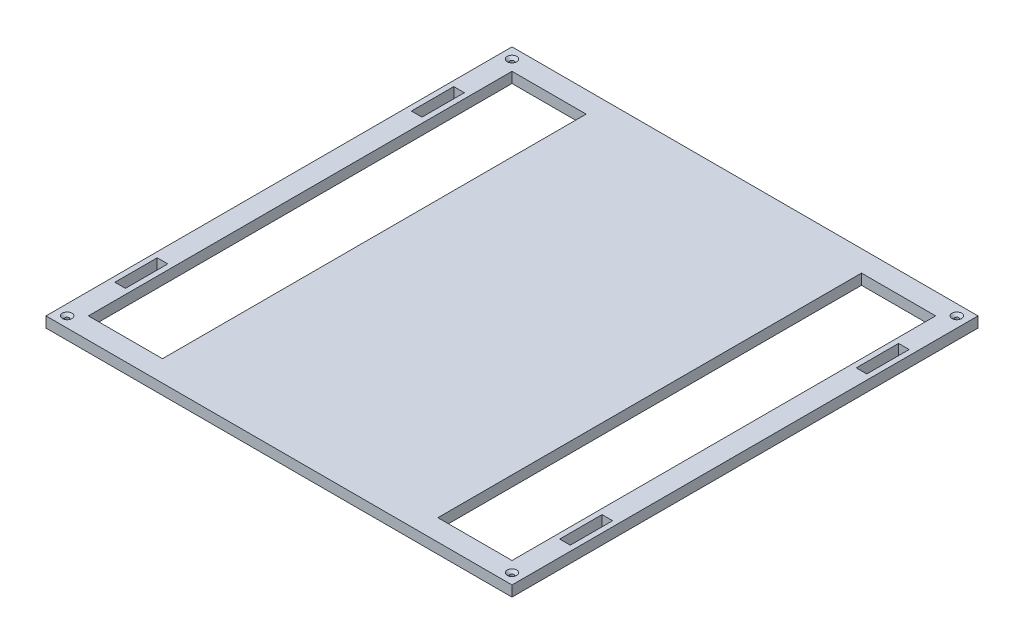
ISO-10303-21;
HEADER;
FILE_DESCRIPTION(('STEP AP214'),'2;1');
FILE_NAME('part.step','',(''),(''),'','','');
FILE_SCHEMA(('AUTOMOTIVE_DESIGN { 1 0 10303 214 1 1 1 1 }'));
ENDSEC;
DATA;
#1=APPLICATION_CONTEXT('core data for automotive mechanical design processes');
#2=APPLICATION_PROTOCOL_DEFINITION('international standard','automotive_design',2000,#1);
#3=PRODUCT_CONTEXT('',#1,'mechanical');
#4=PRODUCT('Part','Part','',(#3));
#5=PRODUCT_RELATED_PRODUCT_CATEGORY('part','',(#4));
#6=PRODUCT_DEFINITION_FORMATION('','',#4);
#7=PRODUCT_DEFINITION_CONTEXT('part definition',#1,'design');
#8=PRODUCT_DEFINITION('design','',#6,#7);
#9=PRODUCT_DEFINITION_SHAPE('','',#8);
#10=(LENGTH_UNIT() NAMED_UNIT(*) SI_UNIT(.MILLI.,.METRE.));
#11=(NAMED_UNIT(*) PLANE_ANGLE_UNIT() SI_UNIT($,.RADIAN.));
#12=(NAMED_UNIT(*) SI_UNIT($,.STERADIAN.) SOLID_ANGLE_UNIT());
#13=UNCERTAINTY_MEASURE_WITH_UNIT(LENGTH_MEASURE(1.E-05),#10,'distance_accuracy_value','');
#14=(GEOMETRIC_REPRESENTATION_CONTEXT(3) GLOBAL_UNCERTAINTY_ASSIGNED_CONTEXT((#13)) GLOBAL_UNIT_ASSIGNED_CONTEXT((#10,
#11,#12)) REPRESENTATION_CONTEXT('',''));
#15=CARTESIAN_POINT('',(0.,0.,0.));
#16=DIRECTION('',(0.,0.,1.));
#17=DIRECTION('',(1.,0.,0.));
#18=AXIS2_PLACEMENT_3D('',#15,#16,#17);
#19=CARTESIAN_POINT('',(139.7,6.35,-139.7));
#20=DIRECTION('',(-1.,0.,0.));
#21=DIRECTION('',(0.,0.,1.));
#22=AXIS2_PLACEMENT_3D('',#19,#20,#21);
#23=PLANE('',#22);
#24=DIRECTION('',(0.,0.,-1.));
#25=VECTOR('',#24,1.);
#26=CARTESIAN_POINT('',(139.7,0.,-139.7));
#27=LINE('',#26,#25);
#28=CARTESIAN_POINT('',(139.7,0.,139.7));
#29=VERTEX_POINT('',#28);
#30=CARTESIAN_POINT('',(139.7,0.,-139.7));
#31=VERTEX_POINT('',#30);
#32=EDGE_CURVE('E412',#29,#31,#27,.T.);
#33=ORIENTED_EDGE('',*,*,#32,.T.);
#34=DIRECTION('',(0.,-1.,0.));
#35=VECTOR('',#34,1.);
#36=CARTESIAN_POINT('',(139.7,6.35,-139.7));
#37=LINE('',#36,#35);
#38=CARTESIAN_POINT('',(139.7,6.35,-139.7));
#39=VERTEX_POINT('',#38);
#40=EDGE_CURVE('E11',#39,#31,#37,.T.);
#41=ORIENTED_EDGE('',*,*,#40,.F.);
#42=DIRECTION('',(0.,0.,-1.));
#43=VECTOR('',#42,1.);
#44=CARTESIAN_POINT('',(139.7,6.35,-139.7));
#45=LINE('',#44,#43);
#46=CARTESIAN_POINT('',(139.7,6.35,139.7));
#47=VERTEX_POINT('',#46);
#48=EDGE_CURVE('E419',#47,#39,#45,.T.);
#49=ORIENTED_EDGE('',*,*,#48,.F.);
#50=DIRECTION('',(0.,-1.,0.));
#51=VECTOR('',#50,1.);
#52=CARTESIAN_POINT('',(139.7,6.35,139.7));
#53=LINE('',#52,#51);
#54=EDGE_CURVE('E429',#47,#29,#53,.T.);
#55=ORIENTED_EDGE('',*,*,#54,.T.);
#56=EDGE_LOOP('',(#33,#41,#49,#55));
#57=FACE_BOUND('',#56,.T.);
#58=ADVANCED_FACE('F32',(#57),#23,.F.);
#59=CARTESIAN_POINT('',(-139.7,6.35,-139.7));
#60=DIRECTION('',(0.,0.,1.));
#61=DIRECTION('',(1.,0.,0.));
#62=AXIS2_PLACEMENT_3D('',#59,#60,#61);
#63=PLANE('',#62);
#64=DIRECTION('',(-1.,0.,0.));
#65=VECTOR('',#64,1.);
#66=CARTESIAN_POINT('',(-139.7,0.,-139.7));
#67=LINE('',#66,#65);
#68=CARTESIAN_POINT('',(-139.7,0.,-139.7));
#69=VERTEX_POINT('',#68);
#70=EDGE_CURVE('E432',#31,#69,#67,.T.);
#71=ORIENTED_EDGE('',*,*,#70,.T.);
#72=DIRECTION('',(0.,-1.,0.));
#73=VECTOR('',#72,1.);
#74=CARTESIAN_POINT('',(-139.7,6.35,-139.7));
#75=LINE('',#74,#73);
#76=CARTESIAN_POINT('',(-139.7,6.35,-139.7));
#77=VERTEX_POINT('',#76);
#78=EDGE_CURVE('E39',#77,#69,#75,.T.);
#79=ORIENTED_EDGE('',*,*,#78,.F.);
#80=DIRECTION('',(-1.,0.,0.));
#81=VECTOR('',#80,1.);
#82=CARTESIAN_POINT('',(-139.7,6.35,-139.7));
#83=LINE('',#82,#81);
#84=EDGE_CURVE('E422',#39,#77,#83,.T.);
#85=ORIENTED_EDGE('',*,*,#84,.F.);
#86=ORIENTED_EDGE('',*,*,#40,.T.);
#87=EDGE_LOOP('',(#71,#79,#85,#86));
#88=FACE_BOUND('',#87,.T.);
#89=ADVANCED_FACE('F461',(#88),#63,.F.);
#90=CARTESIAN_POINT('',(-139.7,6.35,-139.7));
#91=DIRECTION('',(1.,0.,0.));
#92=DIRECTION('',(0.,0.,-1.));
#93=AXIS2_PLACEMENT_3D('',#90,#91,#92);
#94=PLANE('',#93);
#95=DIRECTION('',(0.,0.,1.));
#96=VECTOR('',#95,1.);
#97=CARTESIAN_POINT('',(-139.7,0.,-139.7));
#98=LINE('',#97,#96);
#99=CARTESIAN_POINT('',(-139.7,0.,139.7));
#100=VERTEX_POINT('',#99);
#101=EDGE_CURVE('E434',#69,#100,#98,.T.);
#102=ORIENTED_EDGE('',*,*,#101,.T.);
#103=DIRECTION('',(0.,-1.,0.));
#104=VECTOR('',#103,1.);
#105=CARTESIAN_POINT('',(-139.7,6.35,139.7));
#106=LINE('',#105,#104);
#107=CARTESIAN_POINT('',(-139.7,6.35,139.7));
#108=VERTEX_POINT('',#107);
#109=EDGE_CURVE('E439',#108,#100,#106,.T.);
#110=ORIENTED_EDGE('',*,*,#109,.F.);
#111=DIRECTION('',(0.,0.,1.));
#112=VECTOR('',#111,1.);
#113=CARTESIAN_POINT('',(-139.7,6.35,-139.7));
#114=LINE('',#113,#112);
#115=EDGE_CURVE('E425',#77,#108,#114,.T.);
#116=ORIENTED_EDGE('',*,*,#115,.F.);
#117=ORIENTED_EDGE('',*,*,#78,.T.);
#118=EDGE_LOOP('',(#102,#110,#116,#117));
#119=FACE_BOUND('',#118,.T.);
#120=ADVANCED_FACE('F446',(#119),#94,.F.);
#121=CARTESIAN_POINT('',(-139.7,6.35,139.7));
#122=DIRECTION('',(0.,0.,-1.));
#123=DIRECTION('',(-1.,0.,0.));
#124=AXIS2_PLACEMENT_3D('',#121,#122,#123);
#125=PLANE('',#124);
#126=DIRECTION('',(1.,0.,0.));
#127=VECTOR('',#126,1.);
#128=CARTESIAN_POINT('',(-139.7,0.,139.7));
#129=LINE('',#128,#127);
#130=EDGE_CURVE('E423',#100,#29,#129,.T.);
#131=ORIENTED_EDGE('',*,*,#130,.T.);
#132=ORIENTED_EDGE('',*,*,#54,.F.);
#133=DIRECTION('',(1.,0.,0.));
#134=VECTOR('',#133,1.);
#135=CARTESIAN_POINT('',(-139.7,6.35,139.7));
#136=LINE('',#135,#134);
#137=EDGE_CURVE('E427',#108,#47,#136,.T.);
#138=ORIENTED_EDGE('',*,*,#137,.F.);
#139=ORIENTED_EDGE('',*,*,#109,.T.);
#140=EDGE_LOOP('',(#131,#132,#138,#139));
#141=FACE_BOUND('',#140,.T.);
#142=ADVANCED_FACE('F454',(#141),#125,.F.);
#143=CARTESIAN_POINT('',(0.,6.35,0.));
#144=DIRECTION('',(0.,1.,0.));
#145=DIRECTION('',(0.,0.,1.));
#146=AXIS2_PLACEMENT_3D('',#143,#144,#145);
#147=PLANE('',#146);
#148=CARTESIAN_POINT('',(-133.35,6.35,-133.35));
#149=DIRECTION('',(0.,1.,0.));
#150=DIRECTION('',(0.,0.,1.));
#151=AXIS2_PLACEMENT_3D('',#148,#149,#150);
#152=CIRCLE('',#151,2.85749999999998);
#153=CARTESIAN_POINT('',(-133.35,6.35,-130.4925));
#154=VERTEX_POINT('',#153);
#155=EDGE_CURVE('E606',#154,#154,#152,.T.);
#156=ORIENTED_EDGE('',*,*,#155,.F.);
#157=EDGE_LOOP('',(#156));
#158=FACE_BOUND('',#157,.T.);
#159=CARTESIAN_POINT('',(-133.35,6.35,133.35));
#160=DIRECTION('',(0.,1.,0.));
#161=DIRECTION('',(0.,0.,1.));
#162=AXIS2_PLACEMENT_3D('',#159,#160,#161);
#163=CIRCLE('',#162,2.85749999999998);
#164=CARTESIAN_POINT('',(-133.35,6.35,136.2075));
#165=VERTEX_POINT('',#164);
#166=EDGE_CURVE('E613',#165,#165,#163,.T.);
#167=ORIENTED_EDGE('',*,*,#166,.F.);
#168=EDGE_LOOP('',(#167));
#169=FACE_BOUND('',#168,.T.);
#170=CARTESIAN_POINT('',(133.35,6.35,133.35));
#171=DIRECTION('',(0.,1.,0.));
#172=DIRECTION('',(0.,0.,1.));
#173=AXIS2_PLACEMENT_3D('',#170,#171,#172);
#174=CIRCLE('',#173,2.85749999999998);
#175=CARTESIAN_POINT('',(133.35,6.35,136.2075));
#176=VERTEX_POINT('',#175);
#177=EDGE_CURVE('E622',#176,#176,#174,.T.);
#178=ORIENTED_EDGE('',*,*,#177,.F.);
#179=EDGE_LOOP('',(#178));
#180=FACE_BOUND('',#179,.T.);
#181=CARTESIAN_POINT('',(133.35,6.35,-133.35));
#182=DIRECTION('',(0.,1.,0.));
#183=DIRECTION('',(0.,0.,1.));
#184=AXIS2_PLACEMENT_3D('',#181,#182,#183);
#185=CIRCLE('',#184,2.85749999999998);
#186=CARTESIAN_POINT('',(133.35,6.35,-130.4925));
#187=VERTEX_POINT('',#186);
#188=EDGE_CURVE('E631',#187,#187,#185,.T.);
#189=ORIENTED_EDGE('',*,*,#188,.F.);
#190=EDGE_LOOP('',(#189));
#191=FACE_BOUND('',#190,.T.);
#192=DIRECTION('',(0.,0.,-1.));
#193=VECTOR('',#192,1.);
#194=CARTESIAN_POINT('',(127.,6.35,-127.));
#195=LINE('',#194,#193);
#196=CARTESIAN_POINT('',(127.,6.35,127.));
#197=VERTEX_POINT('',#196);
#198=CARTESIAN_POINT('',(127.,6.35,-127.));
#199=VERTEX_POINT('',#198);
#200=EDGE_CURVE('E46',#197,#199,#195,.T.);
#201=ORIENTED_EDGE('',*,*,#200,.F.);
#202=DIRECTION('',(1.,0.,0.));
#203=VECTOR('',#202,1.);
#204=CARTESIAN_POINT('',(127.,6.35,127.));
#205=LINE('',#204,#203);
#206=CARTESIAN_POINT('',(82.5500000000001,6.35,127.));
#207=VERTEX_POINT('',#206);
#208=EDGE_CURVE('E267',#207,#197,#205,.T.);
#209=ORIENTED_EDGE('',*,*,#208,.F.);
#210=DIRECTION('',(0.,0.,1.));
#211=VECTOR('',#210,1.);
#212=CARTESIAN_POINT('',(82.5500000000001,6.35,-127.));
#213=LINE('',#212,#211);
#214=CARTESIAN_POINT('',(82.5500000000001,6.35,-127.));
#215=VERTEX_POINT('',#214);
#216=EDGE_CURVE('E282',#215,#207,#213,.T.);
#217=ORIENTED_EDGE('',*,*,#216,.F.);
#218=DIRECTION('',(-1.,0.,0.));
#219=VECTOR('',#218,1.);
#220=CARTESIAN_POINT('',(127.,6.35,-127.));
#221=LINE('',#220,#219);
#222=EDGE_CURVE('E278',#199,#215,#221,.T.);
#223=ORIENTED_EDGE('',*,*,#222,.F.);
#224=EDGE_LOOP('',(#201,#209,#217,#223));
#225=FACE_BOUND('',#224,.T.);
#226=DIRECTION('',(0.,0.,1.));
#227=VECTOR('',#226,1.);
#228=CARTESIAN_POINT('',(-136.525,6.35,-101.6));
#229=LINE('',#228,#227);
#230=CARTESIAN_POINT('',(-136.525,6.35,-101.6));
#231=VERTEX_POINT('',#230);
#232=CARTESIAN_POINT('',(-136.525,6.35,-76.2));
#233=VERTEX_POINT('',#232);
#234=EDGE_CURVE('E54',#231,#233,#229,.T.);
#235=ORIENTED_EDGE('',*,*,#234,.F.);
#236=DIRECTION('',(-1.,0.,0.));
#237=VECTOR('',#236,1.);
#238=CARTESIAN_POINT('',(-136.525,6.35,-101.6));
#239=LINE('',#238,#237);
#240=CARTESIAN_POINT('',(-130.175,6.35,-101.6));
#241=VERTEX_POINT('',#240);
#242=EDGE_CURVE('E299',#241,#231,#239,.T.);
#243=ORIENTED_EDGE('',*,*,#242,.F.);
#244=DIRECTION('',(0.,0.,-1.));
#245=VECTOR('',#244,1.);
#246=CARTESIAN_POINT('',(-130.175,6.35,-101.6));
#247=LINE('',#246,#245);
#248=CARTESIAN_POINT('',(-130.175,6.35,-76.2));
#249=VERTEX_POINT('',#248);
#250=EDGE_CURVE('E314',#249,#241,#247,.T.);
#251=ORIENTED_EDGE('',*,*,#250,.F.);
#252=DIRECTION('',(1.,0.,0.));
#253=VECTOR('',#252,1.);
#254=CARTESIAN_POINT('',(-136.525,6.35,-76.2));
#255=LINE('',#254,#253);
#256=EDGE_CURVE('E310',#233,#249,#255,.T.);
#257=ORIENTED_EDGE('',*,*,#256,.F.);
#258=EDGE_LOOP('',(#235,#243,#251,#257));
#259=FACE_BOUND('',#258,.T.);
#260=DIRECTION('',(0.,0.,-1.));
#261=VECTOR('',#260,1.);
#262=CARTESIAN_POINT('',(136.525,6.35,-101.6));
#263=LINE('',#262,#261);
#264=CARTESIAN_POINT('',(136.525,6.35,-76.2000000000001));
#265=VERTEX_POINT('',#264);
#266=CARTESIAN_POINT('',(136.525,6.35,-101.6));
#267=VERTEX_POINT('',#266);
#268=EDGE_CURVE('E339',#265,#267,#263,.T.);
#269=ORIENTED_EDGE('',*,*,#268,.F.);
#270=DIRECTION('',(1.,0.,0.));
#271=VECTOR('',#270,1.);
#272=CARTESIAN_POINT('',(136.525,6.35,-76.2000000000001));
#273=LINE('',#272,#271);
#274=CARTESIAN_POINT('',(130.175,6.35,-76.2000000000001));
#275=VERTEX_POINT('',#274);
#276=EDGE_CURVE('E329',#275,#265,#273,.T.);
#277=ORIENTED_EDGE('',*,*,#276,.F.);
#278=DIRECTION('',(0.,0.,1.));
#279=VECTOR('',#278,1.);
#280=CARTESIAN_POINT('',(130.175,6.35,-101.6));
#281=LINE('',#280,#279);
#282=CARTESIAN_POINT('',(130.175,6.35,-101.6));
#283=VERTEX_POINT('',#282);
#284=EDGE_CURVE('E345',#283,#275,#281,.T.);
#285=ORIENTED_EDGE('',*,*,#284,.F.);
#286=DIRECTION('',(-1.,0.,0.));
#287=VECTOR('',#286,1.);
#288=CARTESIAN_POINT('',(136.525,6.35,-101.6));
#289=LINE('',#288,#287);
#290=EDGE_CURVE('E341',#267,#283,#289,.T.);
#291=ORIENTED_EDGE('',*,*,#290,.F.);
#292=EDGE_LOOP('',(#269,#277,#285,#291));
#293=FACE_BOUND('',#292,.T.);
#294=DIRECTION('',(1.,0.,0.));
#295=VECTOR('',#294,1.);
#296=CARTESIAN_POINT('',(136.525,6.35,101.6));
#297=LINE('',#296,#295);
#298=CARTESIAN_POINT('',(130.175,6.35,101.6));
#299=VERTEX_POINT('',#298);
#300=CARTESIAN_POINT('',(136.525,6.35,101.6));
#301=VERTEX_POINT('',#300);
#302=EDGE_CURVE('E259',#299,#301,#297,.T.);
#303=ORIENTED_EDGE('',*,*,#302,.F.);
#304=DIRECTION('',(0.,0.,1.));
#305=VECTOR('',#304,1.);
#306=CARTESIAN_POINT('',(130.175,6.35,101.6));
#307=LINE('',#306,#305);
#308=CARTESIAN_POINT('',(130.175,6.35,76.2000000000001));
#309=VERTEX_POINT('',#308);
#310=EDGE_CURVE('E361',#309,#299,#307,.T.);
#311=ORIENTED_EDGE('',*,*,#310,.F.);
#312=DIRECTION('',(-1.,0.,0.));
#313=VECTOR('',#312,1.);
#314=CARTESIAN_POINT('',(136.525,6.35,76.2000000000001));
#315=LINE('',#314,#313);
#316=CARTESIAN_POINT('',(136.525,6.35,76.2000000000001));
#317=VERTEX_POINT('',#316);
#318=EDGE_CURVE('E375',#317,#309,#315,.T.);
#319=ORIENTED_EDGE('',*,*,#318,.F.);
#320=DIRECTION('',(0.,0.,-1.));
#321=VECTOR('',#320,1.);
#322=CARTESIAN_POINT('',(136.525,6.35,101.6));
#323=LINE('',#322,#321);
#324=EDGE_CURVE('E372',#301,#317,#323,.T.);
#325=ORIENTED_EDGE('',*,*,#324,.F.);
#326=EDGE_LOOP('',(#303,#311,#319,#325));
#327=FACE_BOUND('',#326,.T.);
#328=DIRECTION('',(0.,0.,1.));
#329=VECTOR('',#328,1.);
#330=CARTESIAN_POINT('',(-136.525,6.35,101.6));
#331=LINE('',#330,#329);
#332=CARTESIAN_POINT('',(-136.525,6.35,76.2));
#333=VERTEX_POINT('',#332);
#334=CARTESIAN_POINT('',(-136.525,6.35,101.6));
#335=VERTEX_POINT('',#334);
#336=EDGE_CURVE('E223',#333,#335,#331,.T.);
#337=ORIENTED_EDGE('',*,*,#336,.F.);
#338=DIRECTION('',(-1.,0.,0.));
#339=VECTOR('',#338,1.);
#340=CARTESIAN_POINT('',(-136.525,6.35,76.2));
#341=LINE('',#340,#339);
#342=CARTESIAN_POINT('',(-130.175,6.35,76.2));
#343=VERTEX_POINT('',#342);
#344=EDGE_CURVE('E241',#343,#333,#341,.T.);
#345=ORIENTED_EDGE('',*,*,#344,.F.);
#346=DIRECTION('',(0.,0.,-1.));
#347=VECTOR('',#346,1.);
#348=CARTESIAN_POINT('',(-130.175,6.35,101.6));
#349=LINE('',#348,#347);
#350=CARTESIAN_POINT('',(-130.175,6.35,101.6));
#351=VERTEX_POINT('',#350);
#352=EDGE_CURVE('E244',#351,#343,#349,.T.);
#353=ORIENTED_EDGE('',*,*,#352,.F.);
#354=DIRECTION('',(1.,0.,0.));
#355=VECTOR('',#354,1.);
#356=CARTESIAN_POINT('',(-136.525,6.35,101.6));
#357=LINE('',#356,#355);
#358=EDGE_CURVE('E253',#335,#351,#357,.T.);
#359=ORIENTED_EDGE('',*,*,#358,.F.);
#360=EDGE_LOOP('',(#337,#345,#353,#359));
#361=FACE_BOUND('',#360,.T.);
#362=DIRECTION('',(0.,0.,1.));
#363=VECTOR('',#362,1.);
#364=CARTESIAN_POINT('',(-127.,6.35,-127.));
#365=LINE('',#364,#363);
#366=CARTESIAN_POINT('',(-127.,6.35,-127.));
#367=VERTEX_POINT('',#366);
#368=CARTESIAN_POINT('',(-127.,6.35,127.));
#369=VERTEX_POINT('',#368);
#370=EDGE_CURVE('E289',#367,#369,#365,.T.);
#371=ORIENTED_EDGE('',*,*,#370,.F.);
#372=DIRECTION('',(-1.,0.,0.));
#373=VECTOR('',#372,1.);
#374=CARTESIAN_POINT('',(-127.,6.35,-127.));
#375=LINE('',#374,#373);
#376=CARTESIAN_POINT('',(-82.55,6.35,-127.));
#377=VERTEX_POINT('',#376);
#378=EDGE_CURVE('E391',#377,#367,#375,.T.);
#379=ORIENTED_EDGE('',*,*,#378,.F.);
#380=DIRECTION('',(0.,0.,-1.));
#381=VECTOR('',#380,1.);
#382=CARTESIAN_POINT('',(-82.55,6.35,-127.));
#383=LINE('',#382,#381);
#384=CARTESIAN_POINT('',(-82.55,6.35,127.));
#385=VERTEX_POINT('',#384);
#386=EDGE_CURVE('E405',#385,#377,#383,.T.);
#387=ORIENTED_EDGE('',*,*,#386,.F.);
#388=DIRECTION('',(1.,0.,0.));
#389=VECTOR('',#388,1.);
#390=CARTESIAN_POINT('',(-127.,6.35,127.));
#391=LINE('',#390,#389);
#392=EDGE_CURVE('E402',#369,#385,#391,.T.);
#393=ORIENTED_EDGE('',*,*,#392,.F.);
#394=EDGE_LOOP('',(#371,#379,#387,#393));
#395=FACE_BOUND('',#394,.T.);
#396=ORIENTED_EDGE('',*,*,#48,.T.);
#397=ORIENTED_EDGE('',*,*,#84,.T.);
#398=ORIENTED_EDGE('',*,*,#115,.T.);
#399=ORIENTED_EDGE('',*,*,#137,.T.);
#400=EDGE_LOOP('',(#396,#397,#398,#399));
#401=FACE_BOUND('',#400,.T.);
#402=ADVANCED_FACE('F460',(#158,#169,#180,#191,#225,#259,#293,#327,#361,#395,#401),#147,.T.);
#403=CARTESIAN_POINT('',(0.,0.,0.));
#404=DIRECTION('',(0.,1.,0.));
#405=DIRECTION('',(0.,0.,1.));
#406=AXIS2_PLACEMENT_3D('',#403,#404,#405);
#407=PLANE('',#406);
#408=CARTESIAN_POINT('',(-133.35,0.,-133.35));
#409=DIRECTION('',(0.,1.,0.));
#410=DIRECTION('',(0.,0.,1.));
#411=AXIS2_PLACEMENT_3D('',#408,#409,#410);
#412=CIRCLE('',#411,1.1303);
#413=CARTESIAN_POINT('',(-133.35,0.,-132.2197));
#414=VERTEX_POINT('',#413);
#415=EDGE_CURVE('E608',#414,#414,#412,.T.);
#416=ORIENTED_EDGE('',*,*,#415,.T.);
#417=EDGE_LOOP('',(#416));
#418=FACE_BOUND('',#417,.T.);
#419=CARTESIAN_POINT('',(-133.35,0.,133.35));
#420=DIRECTION('',(0.,1.,0.));
#421=DIRECTION('',(0.,0.,1.));
#422=AXIS2_PLACEMENT_3D('',#419,#420,#421);
#423=CIRCLE('',#422,1.1303);
#424=CARTESIAN_POINT('',(-133.35,0.,134.4803));
#425=VERTEX_POINT('',#424);
#426=EDGE_CURVE('E619',#425,#425,#423,.T.);
#427=ORIENTED_EDGE('',*,*,#426,.T.);
#428=EDGE_LOOP('',(#427));
#429=FACE_BOUND('',#428,.T.);
#430=CARTESIAN_POINT('',(133.35,0.,133.35));
#431=DIRECTION('',(0.,1.,0.));
#432=DIRECTION('',(0.,0.,1.));
#433=AXIS2_PLACEMENT_3D('',#430,#431,#432);
#434=CIRCLE('',#433,1.1303);
#435=CARTESIAN_POINT('',(133.35,0.,134.4803));
#436=VERTEX_POINT('',#435);
#437=EDGE_CURVE('E628',#436,#436,#434,.T.);
#438=ORIENTED_EDGE('',*,*,#437,.T.);
#439=EDGE_LOOP('',(#438));
#440=FACE_BOUND('',#439,.T.);
#441=CARTESIAN_POINT('',(133.35,0.,-133.35));
#442=DIRECTION('',(0.,1.,0.));
#443=DIRECTION('',(0.,0.,1.));
#444=AXIS2_PLACEMENT_3D('',#441,#442,#443);
#445=CIRCLE('',#444,1.1303);
#446=CARTESIAN_POINT('',(133.35,0.,-132.2197));
#447=VERTEX_POINT('',#446);
#448=EDGE_CURVE('E247',#447,#447,#445,.T.);
#449=ORIENTED_EDGE('',*,*,#448,.T.);
#450=EDGE_LOOP('',(#449));
#451=FACE_BOUND('',#450,.T.);
#452=DIRECTION('',(1.,0.,0.));
#453=VECTOR('',#452,1.);
#454=CARTESIAN_POINT('',(127.,0.,127.));
#455=LINE('',#454,#453);
#456=CARTESIAN_POINT('',(82.5500000000001,0.,127.));
#457=VERTEX_POINT('',#456);
#458=CARTESIAN_POINT('',(127.,0.,127.));
#459=VERTEX_POINT('',#458);
#460=EDGE_CURVE('E273',#457,#459,#455,.T.);
#461=ORIENTED_EDGE('',*,*,#460,.T.);
#462=DIRECTION('',(0.,0.,-1.));
#463=VECTOR('',#462,1.);
#464=CARTESIAN_POINT('',(127.,0.,-127.));
#465=LINE('',#464,#463);
#466=CARTESIAN_POINT('',(127.,0.,-127.));
#467=VERTEX_POINT('',#466);
#468=EDGE_CURVE('E263',#459,#467,#465,.T.);
#469=ORIENTED_EDGE('',*,*,#468,.T.);
#470=DIRECTION('',(-1.,0.,0.));
#471=VECTOR('',#470,1.);
#472=CARTESIAN_POINT('',(127.,0.,-127.));
#473=LINE('',#472,#471);
#474=CARTESIAN_POINT('',(82.5500000000001,0.,-127.));
#475=VERTEX_POINT('',#474);
#476=EDGE_CURVE('E266',#467,#475,#473,.T.);
#477=ORIENTED_EDGE('',*,*,#476,.T.);
#478=DIRECTION('',(0.,0.,1.));
#479=VECTOR('',#478,1.);
#480=CARTESIAN_POINT('',(82.5500000000001,0.,-127.));
#481=LINE('',#480,#479);
#482=EDGE_CURVE('E270',#475,#457,#481,.T.);
#483=ORIENTED_EDGE('',*,*,#482,.T.);
#484=EDGE_LOOP('',(#461,#469,#477,#483));
#485=FACE_BOUND('',#484,.T.);
#486=DIRECTION('',(-1.,0.,0.));
#487=VECTOR('',#486,1.);
#488=CARTESIAN_POINT('',(-136.525,0.,-101.6));
#489=LINE('',#488,#487);
#490=CARTESIAN_POINT('',(-130.175,0.,-101.6));
#491=VERTEX_POINT('',#490);
#492=CARTESIAN_POINT('',(-136.525,0.,-101.6));
#493=VERTEX_POINT('',#492);
#494=EDGE_CURVE('E305',#491,#493,#489,.T.);
#495=ORIENTED_EDGE('',*,*,#494,.T.);
#496=DIRECTION('',(0.,0.,1.));
#497=VECTOR('',#496,1.);
#498=CARTESIAN_POINT('',(-136.525,0.,-101.6));
#499=LINE('',#498,#497);
#500=CARTESIAN_POINT('',(-136.525,0.,-76.2));
#501=VERTEX_POINT('',#500);
#502=EDGE_CURVE('E295',#493,#501,#499,.T.);
#503=ORIENTED_EDGE('',*,*,#502,.T.);
#504=DIRECTION('',(1.,0.,0.));
#505=VECTOR('',#504,1.);
#506=CARTESIAN_POINT('',(-136.525,0.,-76.2));
#507=LINE('',#506,#505);
#508=CARTESIAN_POINT('',(-130.175,0.,-76.2));
#509=VERTEX_POINT('',#508);
#510=EDGE_CURVE('E298',#501,#509,#507,.T.);
#511=ORIENTED_EDGE('',*,*,#510,.T.);
#512=DIRECTION('',(0.,0.,-1.));
#513=VECTOR('',#512,1.);
#514=CARTESIAN_POINT('',(-130.175,0.,-101.6));
#515=LINE('',#514,#513);
#516=EDGE_CURVE('E302',#509,#491,#515,.T.);
#517=ORIENTED_EDGE('',*,*,#516,.T.);
#518=EDGE_LOOP('',(#495,#503,#511,#517));
#519=FACE_BOUND('',#518,.T.);
#520=DIRECTION('',(1.,0.,0.));
#521=VECTOR('',#520,1.);
#522=CARTESIAN_POINT('',(136.525,0.,-76.2000000000001));
#523=LINE('',#522,#521);
#524=CARTESIAN_POINT('',(130.175,0.,-76.2000000000001));
#525=VERTEX_POINT('',#524);
#526=CARTESIAN_POINT('',(136.525,0.,-76.2000000000001));
#527=VERTEX_POINT('',#526);
#528=EDGE_CURVE('E335',#525,#527,#523,.T.);
#529=ORIENTED_EDGE('',*,*,#528,.T.);
#530=DIRECTION('',(0.,0.,-1.));
#531=VECTOR('',#530,1.);
#532=CARTESIAN_POINT('',(136.525,0.,-101.6));
#533=LINE('',#532,#531);
#534=CARTESIAN_POINT('',(136.525,0.,-101.6));
#535=VERTEX_POINT('',#534);
#536=EDGE_CURVE('E325',#527,#535,#533,.T.);
#537=ORIENTED_EDGE('',*,*,#536,.T.);
#538=DIRECTION('',(-1.,0.,0.));
#539=VECTOR('',#538,1.);
#540=CARTESIAN_POINT('',(136.525,0.,-101.6));
#541=LINE('',#540,#539);
#542=CARTESIAN_POINT('',(130.175,0.,-101.6));
#543=VERTEX_POINT('',#542);
#544=EDGE_CURVE('E328',#535,#543,#541,.T.);
#545=ORIENTED_EDGE('',*,*,#544,.T.);
#546=DIRECTION('',(0.,0.,1.));
#547=VECTOR('',#546,1.);
#548=CARTESIAN_POINT('',(130.175,0.,-101.6));
#549=LINE('',#548,#547);
#550=EDGE_CURVE('E332',#543,#525,#549,.T.);
#551=ORIENTED_EDGE('',*,*,#550,.T.);
#552=EDGE_LOOP('',(#529,#537,#545,#551));
#553=FACE_BOUND('',#552,.T.);
#554=DIRECTION('',(0.,0.,1.));
#555=VECTOR('',#554,1.);
#556=CARTESIAN_POINT('',(130.175,0.,101.6));
#557=LINE('',#556,#555);
#558=CARTESIAN_POINT('',(130.175,0.,76.2000000000001));
#559=VERTEX_POINT('',#558);
#560=CARTESIAN_POINT('',(130.175,0.,101.6));
#561=VERTEX_POINT('',#560);
#562=EDGE_CURVE('E367',#559,#561,#557,.T.);
#563=ORIENTED_EDGE('',*,*,#562,.T.);
#564=DIRECTION('',(1.,0.,0.));
#565=VECTOR('',#564,1.);
#566=CARTESIAN_POINT('',(136.525,0.,101.6));
#567=LINE('',#566,#565);
#568=CARTESIAN_POINT('',(136.525,0.,101.6));
#569=VERTEX_POINT('',#568);
#570=EDGE_CURVE('E357',#561,#569,#567,.T.);
#571=ORIENTED_EDGE('',*,*,#570,.T.);
#572=DIRECTION('',(0.,0.,-1.));
#573=VECTOR('',#572,1.);
#574=CARTESIAN_POINT('',(136.525,0.,101.6));
#575=LINE('',#574,#573);
#576=CARTESIAN_POINT('',(136.525,0.,76.2000000000001));
#577=VERTEX_POINT('',#576);
#578=EDGE_CURVE('E360',#569,#577,#575,.T.);
#579=ORIENTED_EDGE('',*,*,#578,.T.);
#580=DIRECTION('',(-1.,0.,0.));
#581=VECTOR('',#580,1.);
#582=CARTESIAN_POINT('',(136.525,0.,76.2000000000001));
#583=LINE('',#582,#581);
#584=EDGE_CURVE('E364',#577,#559,#583,.T.);
#585=ORIENTED_EDGE('',*,*,#584,.T.);
#586=EDGE_LOOP('',(#563,#571,#579,#585));
#587=FACE_BOUND('',#586,.T.);
#588=DIRECTION('',(-1.,0.,0.));
#589=VECTOR('',#588,1.);
#590=CARTESIAN_POINT('',(-136.525,0.,76.2));
#591=LINE('',#590,#589);
#592=CARTESIAN_POINT('',(-130.175,0.,76.2));
#593=VERTEX_POINT('',#592);
#594=CARTESIAN_POINT('',(-136.525,0.,76.2));
#595=VERTEX_POINT('',#594);
#596=EDGE_CURVE('E228',#593,#595,#591,.T.);
#597=ORIENTED_EDGE('',*,*,#596,.T.);
#598=DIRECTION('',(0.,0.,1.));
#599=VECTOR('',#598,1.);
#600=CARTESIAN_POINT('',(-136.525,0.,101.6));
#601=LINE('',#600,#599);
#602=CARTESIAN_POINT('',(-136.525,0.,101.6));
#603=VERTEX_POINT('',#602);
#604=EDGE_CURVE('E220',#595,#603,#601,.T.);
#605=ORIENTED_EDGE('',*,*,#604,.T.);
#606=DIRECTION('',(1.,0.,0.));
#607=VECTOR('',#606,1.);
#608=CARTESIAN_POINT('',(-136.525,0.,101.6));
#609=LINE('',#608,#607);
#610=CARTESIAN_POINT('',(-130.175,0.,101.6));
#611=VERTEX_POINT('',#610);
#612=EDGE_CURVE('E232',#603,#611,#609,.T.);
#613=ORIENTED_EDGE('',*,*,#612,.T.);
#614=DIRECTION('',(0.,0.,-1.));
#615=VECTOR('',#614,1.);
#616=CARTESIAN_POINT('',(-130.175,0.,101.6));
#617=LINE('',#616,#615);
#618=EDGE_CURVE('E236',#611,#593,#617,.T.);
#619=ORIENTED_EDGE('',*,*,#618,.T.);
#620=EDGE_LOOP('',(#597,#605,#613,#619));
#621=FACE_BOUND('',#620,.T.);
#622=DIRECTION('',(-1.,0.,0.));
#623=VECTOR('',#622,1.);
#624=CARTESIAN_POINT('',(-127.,0.,-127.));
#625=LINE('',#624,#623);
#626=CARTESIAN_POINT('',(-82.55,0.,-127.));
#627=VERTEX_POINT('',#626);
#628=CARTESIAN_POINT('',(-127.,0.,-127.));
#629=VERTEX_POINT('',#628);
#630=EDGE_CURVE('E397',#627,#629,#625,.T.);
#631=ORIENTED_EDGE('',*,*,#630,.T.);
#632=DIRECTION('',(0.,0.,1.));
#633=VECTOR('',#632,1.);
#634=CARTESIAN_POINT('',(-127.,0.,-127.));
#635=LINE('',#634,#633);
#636=CARTESIAN_POINT('',(-127.,0.,127.));
#637=VERTEX_POINT('',#636);
#638=EDGE_CURVE('E387',#629,#637,#635,.T.);
#639=ORIENTED_EDGE('',*,*,#638,.T.);
#640=DIRECTION('',(1.,0.,0.));
#641=VECTOR('',#640,1.);
#642=CARTESIAN_POINT('',(-127.,0.,127.));
#643=LINE('',#642,#641);
#644=CARTESIAN_POINT('',(-82.55,0.,127.));
#645=VERTEX_POINT('',#644);
#646=EDGE_CURVE('E390',#637,#645,#643,.T.);
#647=ORIENTED_EDGE('',*,*,#646,.T.);
#648=DIRECTION('',(0.,0.,-1.));
#649=VECTOR('',#648,1.);
#650=CARTESIAN_POINT('',(-82.55,0.,-127.));
#651=LINE('',#650,#649);
#652=EDGE_CURVE('E394',#645,#627,#651,.T.);
#653=ORIENTED_EDGE('',*,*,#652,.T.);
#654=EDGE_LOOP('',(#631,#639,#647,#653));
#655=FACE_BOUND('',#654,.T.);
#656=ORIENTED_EDGE('',*,*,#32,.F.);
#657=ORIENTED_EDGE('',*,*,#130,.F.);
#658=ORIENTED_EDGE('',*,*,#101,.F.);
#659=ORIENTED_EDGE('',*,*,#70,.F.);
#660=EDGE_LOOP('',(#656,#657,#658,#659));
#661=FACE_BOUND('',#660,.T.);
#662=ADVANCED_FACE('F238',(#418,#429,#440,#451,#485,#519,#553,#587,#621,#655,#661),#407,.F.);
#663=CARTESIAN_POINT('',(-127.,0.,-127.));
#664=DIRECTION('',(-1.,0.,0.));
#665=DIRECTION('',(0.,0.,1.));
#666=AXIS2_PLACEMENT_3D('',#663,#664,#665);
#667=PLANE('',#666);
#668=ORIENTED_EDGE('',*,*,#370,.T.);
#669=DIRECTION('',(0.,1.,0.));
#670=VECTOR('',#669,1.);
#671=CARTESIAN_POINT('',(-127.,0.,127.));
#672=LINE('',#671,#670);
#673=EDGE_CURVE('E400',#637,#369,#672,.T.);
#674=ORIENTED_EDGE('',*,*,#673,.F.);
#675=ORIENTED_EDGE('',*,*,#638,.F.);
#676=DIRECTION('',(0.,1.,0.));
#677=VECTOR('',#676,1.);
#678=CARTESIAN_POINT('',(-127.,0.,-127.));
#679=LINE('',#678,#677);
#680=EDGE_CURVE('E410',#629,#367,#679,.T.);
#681=ORIENTED_EDGE('',*,*,#680,.T.);
#682=EDGE_LOOP('',(#668,#674,#675,#681));
#683=FACE_BOUND('',#682,.T.);
#684=ADVANCED_FACE('F473',(#683),#667,.F.);
#685=CARTESIAN_POINT('',(-127.,0.,-127.));
#686=DIRECTION('',(0.,0.,-1.));
#687=DIRECTION('',(-1.,0.,0.));
#688=AXIS2_PLACEMENT_3D('',#685,#686,#687);
#689=PLANE('',#688);
#690=ORIENTED_EDGE('',*,*,#378,.T.);
#691=ORIENTED_EDGE('',*,*,#680,.F.);
#692=ORIENTED_EDGE('',*,*,#630,.F.);
#693=DIRECTION('',(0.,1.,0.));
#694=VECTOR('',#693,1.);
#695=CARTESIAN_POINT('',(-82.55,0.,-127.));
#696=LINE('',#695,#694);
#697=EDGE_CURVE('E413',#627,#377,#696,.T.);
#698=ORIENTED_EDGE('',*,*,#697,.T.);
#699=EDGE_LOOP('',(#690,#691,#692,#698));
#700=FACE_BOUND('',#699,.T.);
#701=ADVANCED_FACE('F480',(#700),#689,.F.);
#702=CARTESIAN_POINT('',(-82.55,0.,-127.));
#703=DIRECTION('',(1.,0.,0.));
#704=DIRECTION('',(0.,0.,-1.));
#705=AXIS2_PLACEMENT_3D('',#702,#703,#704);
#706=PLANE('',#705);
#707=ORIENTED_EDGE('',*,*,#386,.T.);
#708=ORIENTED_EDGE('',*,*,#697,.F.);
#709=ORIENTED_EDGE('',*,*,#652,.F.);
#710=DIRECTION('',(0.,1.,0.));
#711=VECTOR('',#710,1.);
#712=CARTESIAN_POINT('',(-82.55,0.,127.));
#713=LINE('',#712,#711);
#714=EDGE_CURVE('E415',#645,#385,#713,.T.);
#715=ORIENTED_EDGE('',*,*,#714,.T.);
#716=EDGE_LOOP('',(#707,#708,#709,#715));
#717=FACE_BOUND('',#716,.T.);
#718=ADVANCED_FACE('F485',(#717),#706,.F.);
#719=CARTESIAN_POINT('',(-127.,0.,127.));
#720=DIRECTION('',(0.,0.,1.));
#721=DIRECTION('',(1.,0.,0.));
#722=AXIS2_PLACEMENT_3D('',#719,#720,#721);
#723=PLANE('',#722);
#724=ORIENTED_EDGE('',*,*,#392,.T.);
#725=ORIENTED_EDGE('',*,*,#714,.F.);
#726=ORIENTED_EDGE('',*,*,#646,.F.);
#727=ORIENTED_EDGE('',*,*,#673,.T.);
#728=EDGE_LOOP('',(#724,#725,#726,#727));
#729=FACE_BOUND('',#728,.T.);
#730=ADVANCED_FACE('F482',(#729),#723,.F.);
#731=CARTESIAN_POINT('',(-136.525,0.,101.6));
#732=DIRECTION('',(-1.,0.,0.));
#733=DIRECTION('',(0.,0.,1.));
#734=AXIS2_PLACEMENT_3D('',#731,#732,#733);
#735=PLANE('',#734);
#736=ORIENTED_EDGE('',*,*,#336,.T.);
#737=DIRECTION('',(0.,1.,0.));
#738=VECTOR('',#737,1.);
#739=CARTESIAN_POINT('',(-136.525,0.,101.6));
#740=LINE('',#739,#738);
#741=EDGE_CURVE('E216',#603,#335,#740,.T.);
#742=ORIENTED_EDGE('',*,*,#741,.F.);
#743=ORIENTED_EDGE('',*,*,#604,.F.);
#744=DIRECTION('',(0.,1.,0.));
#745=VECTOR('',#744,1.);
#746=CARTESIAN_POINT('',(-136.525,0.,76.2));
#747=LINE('',#746,#745);
#748=EDGE_CURVE('E257',#595,#333,#747,.T.);
#749=ORIENTED_EDGE('',*,*,#748,.T.);
#750=EDGE_LOOP('',(#736,#742,#743,#749));
#751=FACE_BOUND('',#750,.T.);
#752=ADVANCED_FACE('F218',(#751),#735,.F.);
#753=CARTESIAN_POINT('',(-136.525,0.,76.2));
#754=DIRECTION('',(0.,0.,-1.));
#755=DIRECTION('',(-1.,0.,0.));
#756=AXIS2_PLACEMENT_3D('',#753,#754,#755);
#757=PLANE('',#756);
#758=ORIENTED_EDGE('',*,*,#344,.T.);
#759=ORIENTED_EDGE('',*,*,#748,.F.);
#760=ORIENTED_EDGE('',*,*,#596,.F.);
#761=DIRECTION('',(0.,1.,0.));
#762=VECTOR('',#761,1.);
#763=CARTESIAN_POINT('',(-130.175,0.,76.2));
#764=LINE('',#763,#762);
#765=EDGE_CURVE('E260',#593,#343,#764,.T.);
#766=ORIENTED_EDGE('',*,*,#765,.T.);
#767=EDGE_LOOP('',(#758,#759,#760,#766));
#768=FACE_BOUND('',#767,.T.);
#769=ADVANCED_FACE('F558',(#768),#757,.F.);
#770=CARTESIAN_POINT('',(-130.175,0.,101.6));
#771=DIRECTION('',(1.,0.,0.));
#772=DIRECTION('',(0.,0.,-1.));
#773=AXIS2_PLACEMENT_3D('',#770,#771,#772);
#774=PLANE('',#773);
#775=ORIENTED_EDGE('',*,*,#352,.T.);
#776=ORIENTED_EDGE('',*,*,#765,.F.);
#777=ORIENTED_EDGE('',*,*,#618,.F.);
#778=DIRECTION('',(0.,1.,0.));
#779=VECTOR('',#778,1.);
#780=CARTESIAN_POINT('',(-130.175,0.,101.6));
#781=LINE('',#780,#779);
#782=EDGE_CURVE('E227',#611,#351,#781,.T.);
#783=ORIENTED_EDGE('',*,*,#782,.T.);
#784=EDGE_LOOP('',(#775,#776,#777,#783));
#785=FACE_BOUND('',#784,.T.);
#786=ADVANCED_FACE('F561',(#785),#774,.F.);
#787=CARTESIAN_POINT('',(-136.525,0.,101.6));
#788=DIRECTION('',(0.,0.,1.));
#789=DIRECTION('',(1.,0.,0.));
#790=AXIS2_PLACEMENT_3D('',#787,#788,#789);
#791=PLANE('',#790);
#792=ORIENTED_EDGE('',*,*,#358,.T.);
#793=ORIENTED_EDGE('',*,*,#782,.F.);
#794=ORIENTED_EDGE('',*,*,#612,.F.);
#795=ORIENTED_EDGE('',*,*,#741,.T.);
#796=EDGE_LOOP('',(#792,#793,#794,#795));
#797=FACE_BOUND('',#796,.T.);
#798=ADVANCED_FACE('F233',(#797),#791,.F.);
#799=CARTESIAN_POINT('',(136.525,0.,101.6));
#800=DIRECTION('',(0.,0.,1.));
#801=DIRECTION('',(1.,0.,0.));
#802=AXIS2_PLACEMENT_3D('',#799,#800,#801);
#803=PLANE('',#802);
#804=ORIENTED_EDGE('',*,*,#302,.T.);
#805=DIRECTION('',(0.,1.,0.));
#806=VECTOR('',#805,1.);
#807=CARTESIAN_POINT('',(136.525,0.,101.6));
#808=LINE('',#807,#806);
#809=EDGE_CURVE('E370',#569,#301,#808,.T.);
#810=ORIENTED_EDGE('',*,*,#809,.F.);
#811=ORIENTED_EDGE('',*,*,#570,.F.);
#812=DIRECTION('',(0.,1.,0.));
#813=VECTOR('',#812,1.);
#814=CARTESIAN_POINT('',(130.175,0.,101.6));
#815=LINE('',#814,#813);
#816=EDGE_CURVE('E342',#561,#299,#815,.T.);
#817=ORIENTED_EDGE('',*,*,#816,.T.);
#818=EDGE_LOOP('',(#804,#810,#811,#817));
#819=FACE_BOUND('',#818,.T.);
#820=ADVANCED_FACE('F493',(#819),#803,.F.);
#821=CARTESIAN_POINT('',(130.175,0.,101.6));
#822=DIRECTION('',(-1.,0.,0.));
#823=DIRECTION('',(0.,0.,1.));
#824=AXIS2_PLACEMENT_3D('',#821,#822,#823);
#825=PLANE('',#824);
#826=ORIENTED_EDGE('',*,*,#310,.T.);
#827=ORIENTED_EDGE('',*,*,#816,.F.);
#828=ORIENTED_EDGE('',*,*,#562,.F.);
#829=DIRECTION('',(0.,1.,0.));
#830=VECTOR('',#829,1.);
#831=CARTESIAN_POINT('',(130.175,0.,76.2000000000001));
#832=LINE('',#831,#830);
#833=EDGE_CURVE('E381',#559,#309,#832,.T.);
#834=ORIENTED_EDGE('',*,*,#833,.T.);
#835=EDGE_LOOP('',(#826,#827,#828,#834));
#836=FACE_BOUND('',#835,.T.);
#837=ADVANCED_FACE('F496',(#836),#825,.F.);
#838=CARTESIAN_POINT('',(136.525,0.,76.2000000000001));
#839=DIRECTION('',(0.,0.,-1.));
#840=DIRECTION('',(-1.,0.,0.));
#841=AXIS2_PLACEMENT_3D('',#838,#839,#840);
#842=PLANE('',#841);
#843=ORIENTED_EDGE('',*,*,#318,.T.);
#844=ORIENTED_EDGE('',*,*,#833,.F.);
#845=ORIENTED_EDGE('',*,*,#584,.F.);
#846=DIRECTION('',(0.,1.,0.));
#847=VECTOR('',#846,1.);
#848=CARTESIAN_POINT('',(136.525,0.,76.2000000000001));
#849=LINE('',#848,#847);
#850=EDGE_CURVE('E383',#577,#317,#849,.T.);
#851=ORIENTED_EDGE('',*,*,#850,.T.);
#852=EDGE_LOOP('',(#843,#844,#845,#851));
#853=FACE_BOUND('',#852,.T.);
#854=ADVANCED_FACE('F502',(#853),#842,.F.);
#855=CARTESIAN_POINT('',(136.525,0.,101.6));
#856=DIRECTION('',(1.,0.,0.));
#857=DIRECTION('',(0.,0.,-1.));
#858=AXIS2_PLACEMENT_3D('',#855,#856,#857);
#859=PLANE('',#858);
#860=ORIENTED_EDGE('',*,*,#324,.T.);
#861=ORIENTED_EDGE('',*,*,#850,.F.);
#862=ORIENTED_EDGE('',*,*,#578,.F.);
#863=ORIENTED_EDGE('',*,*,#809,.T.);
#864=EDGE_LOOP('',(#860,#861,#862,#863));
#865=FACE_BOUND('',#864,.T.);
#866=ADVANCED_FACE('F498',(#865),#859,.F.);
#867=CARTESIAN_POINT('',(136.525,0.,-101.6));
#868=DIRECTION('',(1.,0.,0.));
#869=DIRECTION('',(0.,0.,-1.));
#870=AXIS2_PLACEMENT_3D('',#867,#868,#869);
#871=PLANE('',#870);
#872=ORIENTED_EDGE('',*,*,#268,.T.);
#873=DIRECTION('',(0.,1.,0.));
#874=VECTOR('',#873,1.);
#875=CARTESIAN_POINT('',(136.525,0.,-101.6));
#876=LINE('',#875,#874);
#877=EDGE_CURVE('E338',#535,#267,#876,.T.);
#878=ORIENTED_EDGE('',*,*,#877,.F.);
#879=ORIENTED_EDGE('',*,*,#536,.F.);
#880=DIRECTION('',(0.,1.,0.));
#881=VECTOR('',#880,1.);
#882=CARTESIAN_POINT('',(136.525,0.,-76.2000000000001));
#883=LINE('',#882,#881);
#884=EDGE_CURVE('E311',#527,#265,#883,.T.);
#885=ORIENTED_EDGE('',*,*,#884,.T.);
#886=EDGE_LOOP('',(#872,#878,#879,#885));
#887=FACE_BOUND('',#886,.T.);
#888=ADVANCED_FACE('F501',(#887),#871,.F.);
#889=CARTESIAN_POINT('',(136.525,0.,-76.2000000000001));
#890=DIRECTION('',(0.,0.,1.));
#891=DIRECTION('',(1.,0.,0.));
#892=AXIS2_PLACEMENT_3D('',#889,#890,#891);
#893=PLANE('',#892);
#894=ORIENTED_EDGE('',*,*,#276,.T.);
#895=ORIENTED_EDGE('',*,*,#884,.F.);
#896=ORIENTED_EDGE('',*,*,#528,.F.);
#897=DIRECTION('',(0.,1.,0.));
#898=VECTOR('',#897,1.);
#899=CARTESIAN_POINT('',(130.175,0.,-76.2000000000001));
#900=LINE('',#899,#898);
#901=EDGE_CURVE('E351',#525,#275,#900,.T.);
#902=ORIENTED_EDGE('',*,*,#901,.T.);
#903=EDGE_LOOP('',(#894,#895,#896,#902));
#904=FACE_BOUND('',#903,.T.);
#905=ADVANCED_FACE('F512',(#904),#893,.F.);
#906=CARTESIAN_POINT('',(130.175,0.,-101.6));
#907=DIRECTION('',(-1.,0.,0.));
#908=DIRECTION('',(0.,0.,1.));
#909=AXIS2_PLACEMENT_3D('',#906,#907,#908);
#910=PLANE('',#909);
#911=ORIENTED_EDGE('',*,*,#284,.T.);
#912=ORIENTED_EDGE('',*,*,#901,.F.);
#913=ORIENTED_EDGE('',*,*,#550,.F.);
#914=DIRECTION('',(0.,1.,0.));
#915=VECTOR('',#914,1.);
#916=CARTESIAN_POINT('',(130.175,0.,-101.6));
#917=LINE('',#916,#915);
#918=EDGE_CURVE('E353',#543,#283,#917,.T.);
#919=ORIENTED_EDGE('',*,*,#918,.T.);
#920=EDGE_LOOP('',(#911,#912,#913,#919));
#921=FACE_BOUND('',#920,.T.);
#922=ADVANCED_FACE('F518',(#921),#910,.F.);
#923=CARTESIAN_POINT('',(136.525,0.,-101.6));
#924=DIRECTION('',(0.,0.,-1.));
#925=DIRECTION('',(-1.,0.,0.));
#926=AXIS2_PLACEMENT_3D('',#923,#924,#925);
#927=PLANE('',#926);
#928=ORIENTED_EDGE('',*,*,#290,.T.);
#929=ORIENTED_EDGE('',*,*,#918,.F.);
#930=ORIENTED_EDGE('',*,*,#544,.F.);
#931=ORIENTED_EDGE('',*,*,#877,.T.);
#932=EDGE_LOOP('',(#928,#929,#930,#931));
#933=FACE_BOUND('',#932,.T.);
#934=ADVANCED_FACE('F514',(#933),#927,.F.);
#935=CARTESIAN_POINT('',(-136.525,0.,-101.6));
#936=DIRECTION('',(-1.,0.,0.));
#937=DIRECTION('',(0.,0.,1.));
#938=AXIS2_PLACEMENT_3D('',#935,#936,#937);
#939=PLANE('',#938);
#940=ORIENTED_EDGE('',*,*,#234,.T.);
#941=DIRECTION('',(0.,1.,0.));
#942=VECTOR('',#941,1.);
#943=CARTESIAN_POINT('',(-136.525,0.,-76.2));
#944=LINE('',#943,#942);
#945=EDGE_CURVE('E308',#501,#233,#944,.T.);
#946=ORIENTED_EDGE('',*,*,#945,.F.);
#947=ORIENTED_EDGE('',*,*,#502,.F.);
#948=DIRECTION('',(0.,1.,0.));
#949=VECTOR('',#948,1.);
#950=CARTESIAN_POINT('',(-136.525,0.,-101.6));
#951=LINE('',#950,#949);
#952=EDGE_CURVE('E279',#493,#231,#951,.T.);
#953=ORIENTED_EDGE('',*,*,#952,.T.);
#954=EDGE_LOOP('',(#940,#946,#947,#953));
#955=FACE_BOUND('',#954,.T.);
#956=ADVANCED_FACE('F517',(#955),#939,.F.);
#957=CARTESIAN_POINT('',(-136.525,0.,-101.6));
#958=DIRECTION('',(0.,0.,-1.));
#959=DIRECTION('',(-1.,0.,0.));
#960=AXIS2_PLACEMENT_3D('',#957,#958,#959);
#961=PLANE('',#960);
#962=ORIENTED_EDGE('',*,*,#242,.T.);
#963=ORIENTED_EDGE('',*,*,#952,.F.);
#964=ORIENTED_EDGE('',*,*,#494,.F.);
#965=DIRECTION('',(0.,1.,0.));
#966=VECTOR('',#965,1.);
#967=CARTESIAN_POINT('',(-130.175,0.,-101.6));
#968=LINE('',#967,#966);
#969=EDGE_CURVE('E320',#491,#241,#968,.T.);
#970=ORIENTED_EDGE('',*,*,#969,.T.);
#971=EDGE_LOOP('',(#962,#963,#964,#970));
#972=FACE_BOUND('',#971,.T.);
#973=ADVANCED_FACE('F528',(#972),#961,.F.);
#974=CARTESIAN_POINT('',(-130.175,0.,-101.6));
#975=DIRECTION('',(1.,0.,0.));
#976=DIRECTION('',(0.,0.,-1.));
#977=AXIS2_PLACEMENT_3D('',#974,#975,#976);
#978=PLANE('',#977);
#979=ORIENTED_EDGE('',*,*,#250,.T.);
#980=ORIENTED_EDGE('',*,*,#969,.F.);
#981=ORIENTED_EDGE('',*,*,#516,.F.);
#982=DIRECTION('',(0.,1.,0.));
#983=VECTOR('',#982,1.);
#984=CARTESIAN_POINT('',(-130.175,0.,-76.2));
#985=LINE('',#984,#983);
#986=EDGE_CURVE('E322',#509,#249,#985,.T.);
#987=ORIENTED_EDGE('',*,*,#986,.T.);
#988=EDGE_LOOP('',(#979,#980,#981,#987));
#989=FACE_BOUND('',#988,.T.);
#990=ADVANCED_FACE('F533',(#989),#978,.F.);
#991=CARTESIAN_POINT('',(-136.525,0.,-76.2));
#992=DIRECTION('',(0.,0.,1.));
#993=DIRECTION('',(1.,0.,0.));
#994=AXIS2_PLACEMENT_3D('',#991,#992,#993);
#995=PLANE('',#994);
#996=ORIENTED_EDGE('',*,*,#256,.T.);
#997=ORIENTED_EDGE('',*,*,#986,.F.);
#998=ORIENTED_EDGE('',*,*,#510,.F.);
#999=ORIENTED_EDGE('',*,*,#945,.T.);
#1000=EDGE_LOOP('',(#996,#997,#998,#999));
#1001=FACE_BOUND('',#1000,.T.);
#1002=ADVANCED_FACE('F529',(#1001),#995,.F.);
#1003=CARTESIAN_POINT('',(127.,0.,-127.));
#1004=DIRECTION('',(1.,0.,0.));
#1005=DIRECTION('',(0.,0.,-1.));
#1006=AXIS2_PLACEMENT_3D('',#1003,#1004,#1005);
#1007=PLANE('',#1006);
#1008=ORIENTED_EDGE('',*,*,#200,.T.);
#1009=DIRECTION('',(0.,1.,0.));
#1010=VECTOR('',#1009,1.);
#1011=CARTESIAN_POINT('',(127.,0.,-127.));
#1012=LINE('',#1011,#1010);
#1013=EDGE_CURVE('E276',#467,#199,#1012,.T.);
#1014=ORIENTED_EDGE('',*,*,#1013,.F.);
#1015=ORIENTED_EDGE('',*,*,#468,.F.);
#1016=DIRECTION('',(0.,1.,0.));
#1017=VECTOR('',#1016,1.);
#1018=CARTESIAN_POINT('',(127.,0.,127.));
#1019=LINE('',#1018,#1017);
#1020=EDGE_CURVE('E287',#459,#197,#1019,.T.);
#1021=ORIENTED_EDGE('',*,*,#1020,.T.);
#1022=EDGE_LOOP('',(#1008,#1014,#1015,#1021));
#1023=FACE_BOUND('',#1022,.T.);
#1024=ADVANCED_FACE('F532',(#1023),#1007,.F.);
#1025=CARTESIAN_POINT('',(127.,0.,127.));
#1026=DIRECTION('',(0.,0.,1.));
#1027=DIRECTION('',(1.,0.,0.));
#1028=AXIS2_PLACEMENT_3D('',#1025,#1026,#1027);
#1029=PLANE('',#1028);
#1030=ORIENTED_EDGE('',*,*,#208,.T.);
#1031=ORIENTED_EDGE('',*,*,#1020,.F.);
#1032=ORIENTED_EDGE('',*,*,#460,.F.);
#1033=DIRECTION('',(0.,1.,0.));
#1034=VECTOR('',#1033,1.);
#1035=CARTESIAN_POINT('',(82.5500000000001,0.,127.));
#1036=LINE('',#1035,#1034);
#1037=EDGE_CURVE('E290',#457,#207,#1036,.T.);
#1038=ORIENTED_EDGE('',*,*,#1037,.T.);
#1039=EDGE_LOOP('',(#1030,#1031,#1032,#1038));
#1040=FACE_BOUND('',#1039,.T.);
#1041=ADVANCED_FACE('F543',(#1040),#1029,.F.);
#1042=CARTESIAN_POINT('',(82.5500000000001,0.,-127.));
#1043=DIRECTION('',(-1.,0.,0.));
#1044=DIRECTION('',(0.,0.,1.));
#1045=AXIS2_PLACEMENT_3D('',#1042,#1043,#1044);
#1046=PLANE('',#1045);
#1047=ORIENTED_EDGE('',*,*,#216,.T.);
#1048=ORIENTED_EDGE('',*,*,#1037,.F.);
#1049=ORIENTED_EDGE('',*,*,#482,.F.);
#1050=DIRECTION('',(0.,1.,0.));
#1051=VECTOR('',#1050,1.);
#1052=CARTESIAN_POINT('',(82.5500000000001,0.,-127.));
#1053=LINE('',#1052,#1051);
#1054=EDGE_CURVE('E292',#475,#215,#1053,.T.);
#1055=ORIENTED_EDGE('',*,*,#1054,.T.);
#1056=EDGE_LOOP('',(#1047,#1048,#1049,#1055));
#1057=FACE_BOUND('',#1056,.T.);
#1058=ADVANCED_FACE('F548',(#1057),#1046,.F.);
#1059=CARTESIAN_POINT('',(127.,0.,-127.));
#1060=DIRECTION('',(0.,0.,-1.));
#1061=DIRECTION('',(-1.,0.,0.));
#1062=AXIS2_PLACEMENT_3D('',#1059,#1060,#1061);
#1063=PLANE('',#1062);
#1064=ORIENTED_EDGE('',*,*,#222,.T.);
#1065=ORIENTED_EDGE('',*,*,#1054,.F.);
#1066=ORIENTED_EDGE('',*,*,#476,.F.);
#1067=ORIENTED_EDGE('',*,*,#1013,.T.);
#1068=EDGE_LOOP('',(#1064,#1065,#1066,#1067));
#1069=FACE_BOUND('',#1068,.T.);
#1070=ADVANCED_FACE('F544',(#1069),#1063,.F.);
#1071=CARTESIAN_POINT('',(133.35,6.35,-133.35));
#1072=DIRECTION('',(0.,1.,0.));
#1073=DIRECTION('',(0.,0.,1.));
#1074=AXIS2_PLACEMENT_3D('',#1071,#1072,#1073);
#1075=CYLINDRICAL_SURFACE('',#1074,1.1303);
#1076=ORIENTED_EDGE('',*,*,#448,.F.);
#1077=EDGE_LOOP('',(#1076));
#1078=FACE_BOUND('',#1077,.T.);
#1079=CARTESIAN_POINT('',(133.35,4.9007071170306,-133.35));
#1080=DIRECTION('',(0.,1.,0.));
#1081=DIRECTION('',(0.,0.,1.));
#1082=AXIS2_PLACEMENT_3D('',#1079,#1080,#1081);
#1083=CIRCLE('',#1082,1.1303);
#1084=CARTESIAN_POINT('',(133.35,4.9007071170306,-132.2197));
#1085=VERTEX_POINT('',#1084);
#1086=EDGE_CURVE('E633',#1085,#1085,#1083,.T.);
#1087=ORIENTED_EDGE('',*,*,#1086,.T.);
#1088=EDGE_LOOP('',(#1087));
#1089=FACE_BOUND('',#1088,.T.);
#1090=ADVANCED_FACE('F547',(#1078,#1089),#1075,.F.);
#1091=CARTESIAN_POINT('',(133.35,6.35,-133.35));
#1092=DIRECTION('',(0.,1.,0.));
#1093=DIRECTION('',(0.,0.,1.));
#1094=AXIS2_PLACEMENT_3D('',#1091,#1092,#1093);
#1095=CONICAL_SURFACE('',#1094,2.85749999999998,0.87266462599716);
#1096=ORIENTED_EDGE('',*,*,#1086,.F.);
#1097=EDGE_LOOP('',(#1096));
#1098=FACE_BOUND('',#1097,.T.);
#1099=ORIENTED_EDGE('',*,*,#188,.T.);
#1100=EDGE_LOOP('',(#1099));
#1101=FACE_BOUND('',#1100,.T.);
#1102=ADVANCED_FACE('F570',(#1098,#1101),#1095,.F.);
#1103=CARTESIAN_POINT('',(133.35,6.35,133.35));
#1104=DIRECTION('',(0.,1.,0.));
#1105=DIRECTION('',(0.,0.,1.));
#1106=AXIS2_PLACEMENT_3D('',#1103,#1104,#1105);
#1107=CYLINDRICAL_SURFACE('',#1106,1.1303);
#1108=ORIENTED_EDGE('',*,*,#437,.F.);
#1109=EDGE_LOOP('',(#1108));
#1110=FACE_BOUND('',#1109,.T.);
#1111=CARTESIAN_POINT('',(133.35,4.9007071170306,133.35));
#1112=DIRECTION('',(0.,1.,0.));
#1113=DIRECTION('',(0.,0.,1.));
#1114=AXIS2_PLACEMENT_3D('',#1111,#1112,#1113);
#1115=CIRCLE('',#1114,1.1303);
#1116=CARTESIAN_POINT('',(133.35,4.9007071170306,134.4803));
#1117=VERTEX_POINT('',#1116);
#1118=EDGE_CURVE('E625',#1117,#1117,#1115,.T.);
#1119=ORIENTED_EDGE('',*,*,#1118,.T.);
#1120=EDGE_LOOP('',(#1119));
#1121=FACE_BOUND('',#1120,.T.);
#1122=ADVANCED_FACE('F574',(#1110,#1121),#1107,.F.);
#1123=CARTESIAN_POINT('',(133.35,6.35,133.35));
#1124=DIRECTION('',(0.,1.,0.));
#1125=DIRECTION('',(0.,0.,1.));
#1126=AXIS2_PLACEMENT_3D('',#1123,#1124,#1125);
#1127=CONICAL_SURFACE('',#1126,2.85749999999998,0.87266462599716);
#1128=ORIENTED_EDGE('',*,*,#1118,.F.);
#1129=EDGE_LOOP('',(#1128));
#1130=FACE_BOUND('',#1129,.T.);
#1131=ORIENTED_EDGE('',*,*,#177,.T.);
#1132=EDGE_LOOP('',(#1131));
#1133=FACE_BOUND('',#1132,.T.);
#1134=ADVANCED_FACE('F578',(#1130,#1133),#1127,.F.);
#1135=CARTESIAN_POINT('',(-133.35,6.35,133.35));
#1136=DIRECTION('',(0.,1.,0.));
#1137=DIRECTION('',(0.,0.,1.));
#1138=AXIS2_PLACEMENT_3D('',#1135,#1136,#1137);
#1139=CYLINDRICAL_SURFACE('',#1138,1.1303);
#1140=ORIENTED_EDGE('',*,*,#426,.F.);
#1141=EDGE_LOOP('',(#1140));
#1142=FACE_BOUND('',#1141,.T.);
#1143=CARTESIAN_POINT('',(-133.35,4.9007071170306,133.35));
#1144=DIRECTION('',(0.,1.,0.));
#1145=DIRECTION('',(0.,0.,1.));
#1146=AXIS2_PLACEMENT_3D('',#1143,#1144,#1145);
#1147=CIRCLE('',#1146,1.1303);
#1148=CARTESIAN_POINT('',(-133.35,4.9007071170306,134.4803));
#1149=VERTEX_POINT('',#1148);
#1150=EDGE_CURVE('E616',#1149,#1149,#1147,.T.);
#1151=ORIENTED_EDGE('',*,*,#1150,.T.);
#1152=EDGE_LOOP('',(#1151));
#1153=FACE_BOUND('',#1152,.T.);
#1154=ADVANCED_FACE('F582',(#1142,#1153),#1139,.F.);
#1155=CARTESIAN_POINT('',(-133.35,6.35,133.35));
#1156=DIRECTION('',(0.,1.,0.));
#1157=DIRECTION('',(0.,0.,1.));
#1158=AXIS2_PLACEMENT_3D('',#1155,#1156,#1157);
#1159=CONICAL_SURFACE('',#1158,2.85749999999998,0.87266462599716);
#1160=ORIENTED_EDGE('',*,*,#1150,.F.);
#1161=EDGE_LOOP('',(#1160));
#1162=FACE_BOUND('',#1161,.T.);
#1163=ORIENTED_EDGE('',*,*,#166,.T.);
#1164=EDGE_LOOP('',(#1163));
#1165=FACE_BOUND('',#1164,.T.);
#1166=ADVANCED_FACE('F586',(#1162,#1165),#1159,.F.);
#1167=CARTESIAN_POINT('',(-133.35,6.35,-133.35));
#1168=DIRECTION('',(0.,1.,0.));
#1169=DIRECTION('',(0.,0.,1.));
#1170=AXIS2_PLACEMENT_3D('',#1167,#1168,#1169);
#1171=CYLINDRICAL_SURFACE('',#1170,1.1303);
#1172=ORIENTED_EDGE('',*,*,#415,.F.);
#1173=EDGE_LOOP('',(#1172));
#1174=FACE_BOUND('',#1173,.T.);
#1175=CARTESIAN_POINT('',(-133.35,4.9007071170306,-133.35));
#1176=DIRECTION('',(0.,1.,0.));
#1177=DIRECTION('',(0.,0.,1.));
#1178=AXIS2_PLACEMENT_3D('',#1175,#1176,#1177);
#1179=CIRCLE('',#1178,1.1303);
#1180=CARTESIAN_POINT('',(-133.35,4.9007071170306,-132.2197));
#1181=VERTEX_POINT('',#1180);
#1182=EDGE_CURVE('E603',#1181,#1181,#1179,.T.);
#1183=ORIENTED_EDGE('',*,*,#1182,.T.);
#1184=EDGE_LOOP('',(#1183));
#1185=FACE_BOUND('',#1184,.T.);
#1186=ADVANCED_FACE('F590',(#1174,#1185),#1171,.F.);
#1187=CARTESIAN_POINT('',(-133.35,6.35,-133.35));
#1188=DIRECTION('',(0.,1.,0.));
#1189=DIRECTION('',(0.,0.,1.));
#1190=AXIS2_PLACEMENT_3D('',#1187,#1188,#1189);
#1191=CONICAL_SURFACE('',#1190,2.85749999999998,0.87266462599716);
#1192=ORIENTED_EDGE('',*,*,#1182,.F.);
#1193=EDGE_LOOP('',(#1192));
#1194=FACE_BOUND('',#1193,.T.);
#1195=ORIENTED_EDGE('',*,*,#155,.T.);
#1196=EDGE_LOOP('',(#1195));
#1197=FACE_BOUND('',#1196,.T.);
#1198=ADVANCED_FACE('F594',(#1194,#1197),#1191,.F.);
#1199=CLOSED_SHELL('',(#58,#89,#120,#142,#402,#662,#684,#701,#718,#730,#752,#769,#786,#798,#820,
#837,#854,#866,#888,#905,#922,#934,#956,#973,#990,#1002,#1024,#1041,#1058,#1070,#1090,#1102,
#1122,#1134,#1154,#1166,#1186,#1198));
#1200=MANIFOLD_SOLID_BREP('B2',#1199);
#1201=ADVANCED_BREP_SHAPE_REPRESENTATION('',(#18,#1200),#14);
#1202=SHAPE_DEFINITION_REPRESENTATION(#9,#1201);
ENDSEC;
END-ISO-10303-21;
